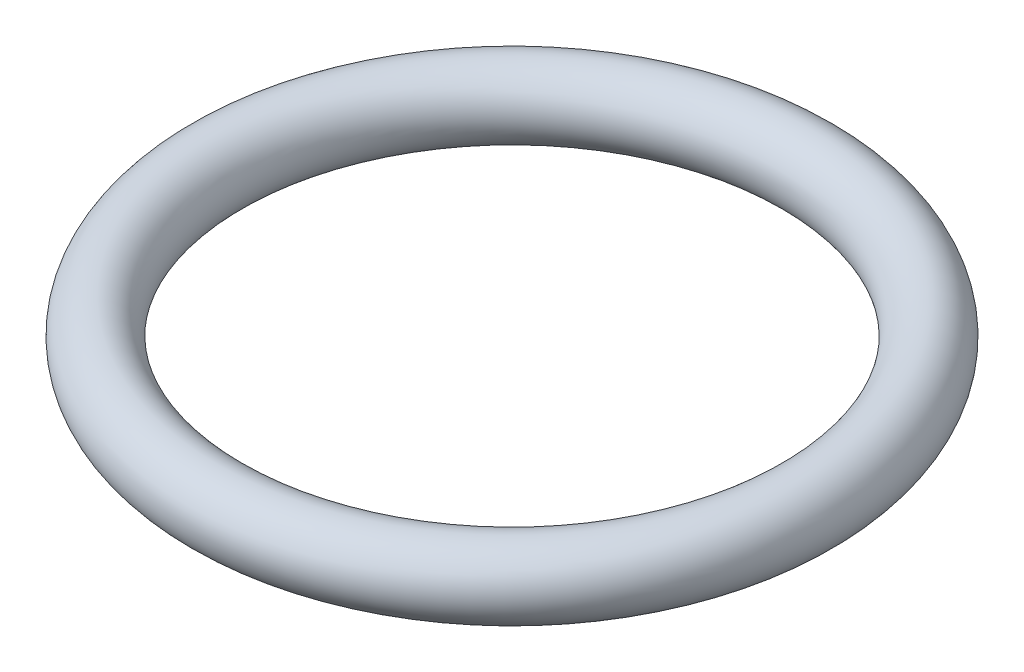
ISO-10303-21;
HEADER;
FILE_DESCRIPTION(('STEP AP214'),'2;1');
FILE_NAME('part.step','',(''),(''),'','','');
FILE_SCHEMA(('AUTOMOTIVE_DESIGN { 1 0 10303 214 1 1 1 1 }'));
ENDSEC;
DATA;
#1=APPLICATION_CONTEXT('core data for automotive mechanical design processes');
#2=APPLICATION_PROTOCOL_DEFINITION('international standard','automotive_design',2000,#1);
#3=PRODUCT_CONTEXT('',#1,'mechanical');
#4=PRODUCT('Part','Part','',(#3));
#5=PRODUCT_RELATED_PRODUCT_CATEGORY('part','',(#4));
#6=PRODUCT_DEFINITION_FORMATION('','',#4);
#7=PRODUCT_DEFINITION_CONTEXT('part definition',#1,'design');
#8=PRODUCT_DEFINITION('design','',#6,#7);
#9=PRODUCT_DEFINITION_SHAPE('','',#8);
#10=(LENGTH_UNIT() NAMED_UNIT(*) SI_UNIT(.MILLI.,.METRE.));
#11=(NAMED_UNIT(*) PLANE_ANGLE_UNIT() SI_UNIT($,.RADIAN.));
#12=(NAMED_UNIT(*) SI_UNIT($,.STERADIAN.) SOLID_ANGLE_UNIT());
#13=UNCERTAINTY_MEASURE_WITH_UNIT(LENGTH_MEASURE(1.E-05),#10,'distance_accuracy_value','');
#14=(GEOMETRIC_REPRESENTATION_CONTEXT(3) GLOBAL_UNCERTAINTY_ASSIGNED_CONTEXT((#13)) GLOBAL_UNIT_ASSIGNED_CONTEXT((#10,
#11,#12)) REPRESENTATION_CONTEXT('',''));
#15=CARTESIAN_POINT('',(0.,0.,0.));
#16=DIRECTION('',(0.,0.,1.));
#17=DIRECTION('',(1.,0.,0.));
#18=AXIS2_PLACEMENT_3D('',#15,#16,#17);
#19=CARTESIAN_POINT('',(0.,0.,0.));
#20=DIRECTION('',(0.,-1.,0.));
#21=DIRECTION('',(0.,0.,-1.));
#22=AXIS2_PLACEMENT_3D('',#19,#20,#21);
#23=TOROIDAL_SURFACE('',#22,442.5,52.5);
#24=CARTESIAN_POINT('',(0.,0.,-495.));
#25=VERTEX_POINT('',#24);
#26=VERTEX_LOOP('',#25);
#27=FACE_BOUND('',#26,.T.);
#28=ADVANCED_FACE('F33',(#27),#23,.T.);
#29=CLOSED_SHELL('',(#28));
#30=CARTESIAN_POINT('',(0.,0.,0.));
#31=DIRECTION('',(0.,-1.,0.));
#32=DIRECTION('',(0.,0.,-1.));
#33=AXIS2_PLACEMENT_3D('',#30,#31,#32);
#34=TOROIDAL_SURFACE('',#33,442.5,42.5);
#35=CARTESIAN_POINT('',(0.,0.,-485.));
#36=VERTEX_POINT('',#35);
#37=VERTEX_LOOP('',#36);
#38=FACE_BOUND('',#37,.T.);
#39=ADVANCED_FACE('F45',(#38),#34,.F.);
#40=CLOSED_SHELL('',(#39));
#41=ORIENTED_CLOSED_SHELL('',*,#40,.T.);
#42=BREP_WITH_VOIDS('B2',#29,(#41));
#43=ADVANCED_BREP_SHAPE_REPRESENTATION('',(#18,#42),#14);
#44=SHAPE_DEFINITION_REPRESENTATION(#9,#43);
ENDSEC;
END-ISO-10303-21;
